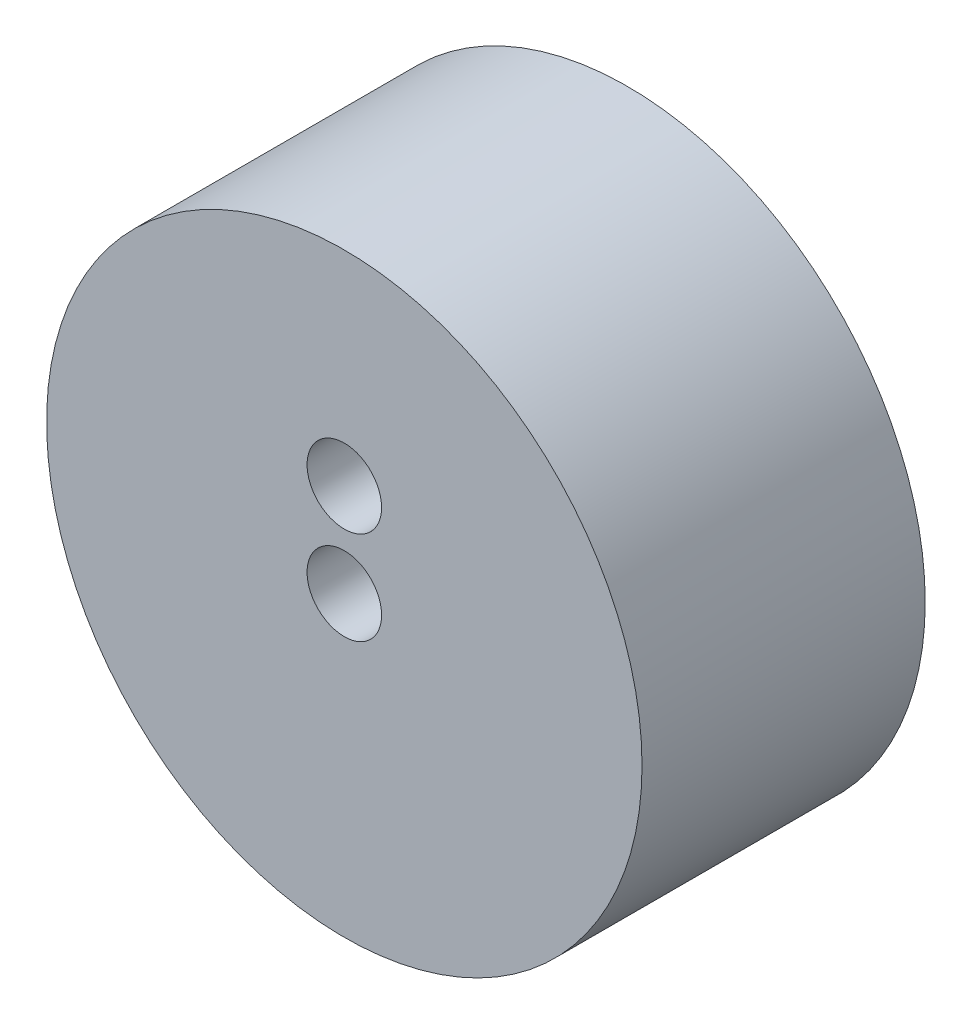
ISO-10303-21;
HEADER;
FILE_DESCRIPTION(('STEP AP214'),'2;1');
FILE_NAME('part.step','',(''),(''),'','','');
FILE_SCHEMA(('AUTOMOTIVE_DESIGN { 1 0 10303 214 1 1 1 1 }'));
ENDSEC;
DATA;
#1=APPLICATION_CONTEXT('core data for automotive mechanical design processes');
#2=APPLICATION_PROTOCOL_DEFINITION('international standard','automotive_design',2000,#1);
#3=PRODUCT_CONTEXT('',#1,'mechanical');
#4=PRODUCT('Part','Part','',(#3));
#5=PRODUCT_RELATED_PRODUCT_CATEGORY('part','',(#4));
#6=PRODUCT_DEFINITION_FORMATION('','',#4);
#7=PRODUCT_DEFINITION_CONTEXT('part definition',#1,'design');
#8=PRODUCT_DEFINITION('design','',#6,#7);
#9=PRODUCT_DEFINITION_SHAPE('','',#8);
#10=(LENGTH_UNIT() NAMED_UNIT(*) SI_UNIT(.MILLI.,.METRE.));
#11=(NAMED_UNIT(*) PLANE_ANGLE_UNIT() SI_UNIT($,.RADIAN.));
#12=(NAMED_UNIT(*) SI_UNIT($,.STERADIAN.) SOLID_ANGLE_UNIT());
#13=UNCERTAINTY_MEASURE_WITH_UNIT(LENGTH_MEASURE(1.E-05),#10,'distance_accuracy_value','');
#14=(GEOMETRIC_REPRESENTATION_CONTEXT(3) GLOBAL_UNCERTAINTY_ASSIGNED_CONTEXT((#13)) GLOBAL_UNIT_ASSIGNED_CONTEXT((#10,
#11,#12)) REPRESENTATION_CONTEXT('',''));
#15=CARTESIAN_POINT('',(0.,0.,0.));
#16=DIRECTION('',(0.,0.,1.));
#17=DIRECTION('',(1.,0.,0.));
#18=AXIS2_PLACEMENT_3D('',#15,#16,#17);
#19=CARTESIAN_POINT('',(0.,0.,15.2));
#20=DIRECTION('',(0.,0.,-1.));
#21=DIRECTION('',(-1.,0.,0.));
#22=AXIS2_PLACEMENT_3D('',#19,#20,#21);
#23=CYLINDRICAL_SURFACE('',#22,15.98);
#24=CARTESIAN_POINT('',(0.,0.,15.2));
#25=DIRECTION('',(0.,0.,1.));
#26=DIRECTION('',(1.,0.,0.));
#27=AXIS2_PLACEMENT_3D('',#24,#25,#26);
#28=CIRCLE('',#27,15.98);
#29=CARTESIAN_POINT('',(15.98,0.,15.2));
#30=VERTEX_POINT('',#29);
#31=EDGE_CURVE('E10',#30,#30,#28,.T.);
#32=ORIENTED_EDGE('',*,*,#31,.F.);
#33=EDGE_LOOP('',(#32));
#34=FACE_BOUND('',#33,.T.);
#35=CARTESIAN_POINT('',(0.,0.,0.));
#36=DIRECTION('',(0.,0.,1.));
#37=DIRECTION('',(1.,0.,0.));
#38=AXIS2_PLACEMENT_3D('',#35,#36,#37);
#39=CIRCLE('',#38,15.98);
#40=CARTESIAN_POINT('',(15.98,0.,0.));
#41=VERTEX_POINT('',#40);
#42=EDGE_CURVE('E35',#41,#41,#39,.T.);
#43=ORIENTED_EDGE('',*,*,#42,.T.);
#44=EDGE_LOOP('',(#43));
#45=FACE_BOUND('',#44,.T.);
#46=ADVANCED_FACE('F32',(#34,#45),#23,.T.);
#47=CARTESIAN_POINT('',(0.,0.,15.2));
#48=DIRECTION('',(0.,0.,1.));
#49=DIRECTION('',(1.,0.,0.));
#50=AXIS2_PLACEMENT_3D('',#47,#48,#49);
#51=PLANE('',#50);
#52=CARTESIAN_POINT('',(0.,5.,15.2));
#53=DIRECTION('',(0.,0.,1.));
#54=DIRECTION('',(1.,0.,0.));
#55=AXIS2_PLACEMENT_3D('',#52,#53,#54);
#56=CIRCLE('',#55,2.);
#57=CARTESIAN_POINT('',(2.,5.,15.2));
#58=VERTEX_POINT('',#57);
#59=EDGE_CURVE('E50',#58,#58,#56,.T.);
#60=ORIENTED_EDGE('',*,*,#59,.F.);
#61=EDGE_LOOP('',(#60));
#62=FACE_BOUND('',#61,.T.);
#63=CARTESIAN_POINT('',(0.,0.,15.2));
#64=DIRECTION('',(0.,0.,1.));
#65=DIRECTION('',(1.,0.,0.));
#66=AXIS2_PLACEMENT_3D('',#63,#64,#65);
#67=CIRCLE('',#66,2.);
#68=CARTESIAN_POINT('',(2.,0.,15.2));
#69=VERTEX_POINT('',#68);
#70=EDGE_CURVE('E44',#69,#69,#67,.T.);
#71=ORIENTED_EDGE('',*,*,#70,.F.);
#72=EDGE_LOOP('',(#71));
#73=FACE_BOUND('',#72,.T.);
#74=ORIENTED_EDGE('',*,*,#31,.T.);
#75=EDGE_LOOP('',(#74));
#76=FACE_BOUND('',#75,.T.);
#77=ADVANCED_FACE('F66',(#62,#73,#76),#51,.T.);
#78=CARTESIAN_POINT('',(0.,0.,0.));
#79=DIRECTION('',(0.,0.,1.));
#80=DIRECTION('',(1.,0.,0.));
#81=AXIS2_PLACEMENT_3D('',#78,#79,#80);
#82=PLANE('',#81);
#83=CARTESIAN_POINT('',(0.,5.,0.));
#84=DIRECTION('',(0.,0.,1.));
#85=DIRECTION('',(1.,0.,0.));
#86=AXIS2_PLACEMENT_3D('',#83,#84,#85);
#87=CIRCLE('',#86,2.);
#88=CARTESIAN_POINT('',(2.,5.,0.));
#89=VERTEX_POINT('',#88);
#90=EDGE_CURVE('E47',#89,#89,#87,.T.);
#91=ORIENTED_EDGE('',*,*,#90,.T.);
#92=EDGE_LOOP('',(#91));
#93=FACE_BOUND('',#92,.T.);
#94=CARTESIAN_POINT('',(0.,0.,0.));
#95=DIRECTION('',(0.,0.,1.));
#96=DIRECTION('',(1.,0.,0.));
#97=AXIS2_PLACEMENT_3D('',#94,#95,#96);
#98=CIRCLE('',#97,2.);
#99=CARTESIAN_POINT('',(2.,0.,0.));
#100=VERTEX_POINT('',#99);
#101=EDGE_CURVE('E42',#100,#100,#98,.T.);
#102=ORIENTED_EDGE('',*,*,#101,.T.);
#103=EDGE_LOOP('',(#102));
#104=FACE_BOUND('',#103,.T.);
#105=ORIENTED_EDGE('',*,*,#42,.F.);
#106=EDGE_LOOP('',(#105));
#107=FACE_BOUND('',#106,.T.);
#108=ADVANCED_FACE('F56',(#93,#104,#107),#82,.F.);
#109=CARTESIAN_POINT('',(0.,0.,0.));
#110=DIRECTION('',(0.,0.,1.));
#111=DIRECTION('',(1.,0.,0.));
#112=AXIS2_PLACEMENT_3D('',#109,#110,#111);
#113=CYLINDRICAL_SURFACE('',#112,2.);
#114=ORIENTED_EDGE('',*,*,#101,.F.);
#115=EDGE_LOOP('',(#114));
#116=FACE_BOUND('',#115,.T.);
#117=ORIENTED_EDGE('',*,*,#70,.T.);
#118=EDGE_LOOP('',(#117));
#119=FACE_BOUND('',#118,.T.);
#120=ADVANCED_FACE('F62',(#116,#119),#113,.F.);
#121=CARTESIAN_POINT('',(0.,5.,0.));
#122=DIRECTION('',(0.,0.,1.));
#123=DIRECTION('',(1.,0.,0.));
#124=AXIS2_PLACEMENT_3D('',#121,#122,#123);
#125=CYLINDRICAL_SURFACE('',#124,2.);
#126=ORIENTED_EDGE('',*,*,#90,.F.);
#127=EDGE_LOOP('',(#126));
#128=FACE_BOUND('',#127,.T.);
#129=ORIENTED_EDGE('',*,*,#59,.T.);
#130=EDGE_LOOP('',(#129));
#131=FACE_BOUND('',#130,.T.);
#132=ADVANCED_FACE('F59',(#128,#131),#125,.F.);
#133=CLOSED_SHELL('',(#46,#77,#108,#120,#132));
#134=MANIFOLD_SOLID_BREP('B2',#133);
#135=ADVANCED_BREP_SHAPE_REPRESENTATION('',(#18,#134),#14);
#136=SHAPE_DEFINITION_REPRESENTATION(#9,#135);
ENDSEC;
END-ISO-10303-21;
